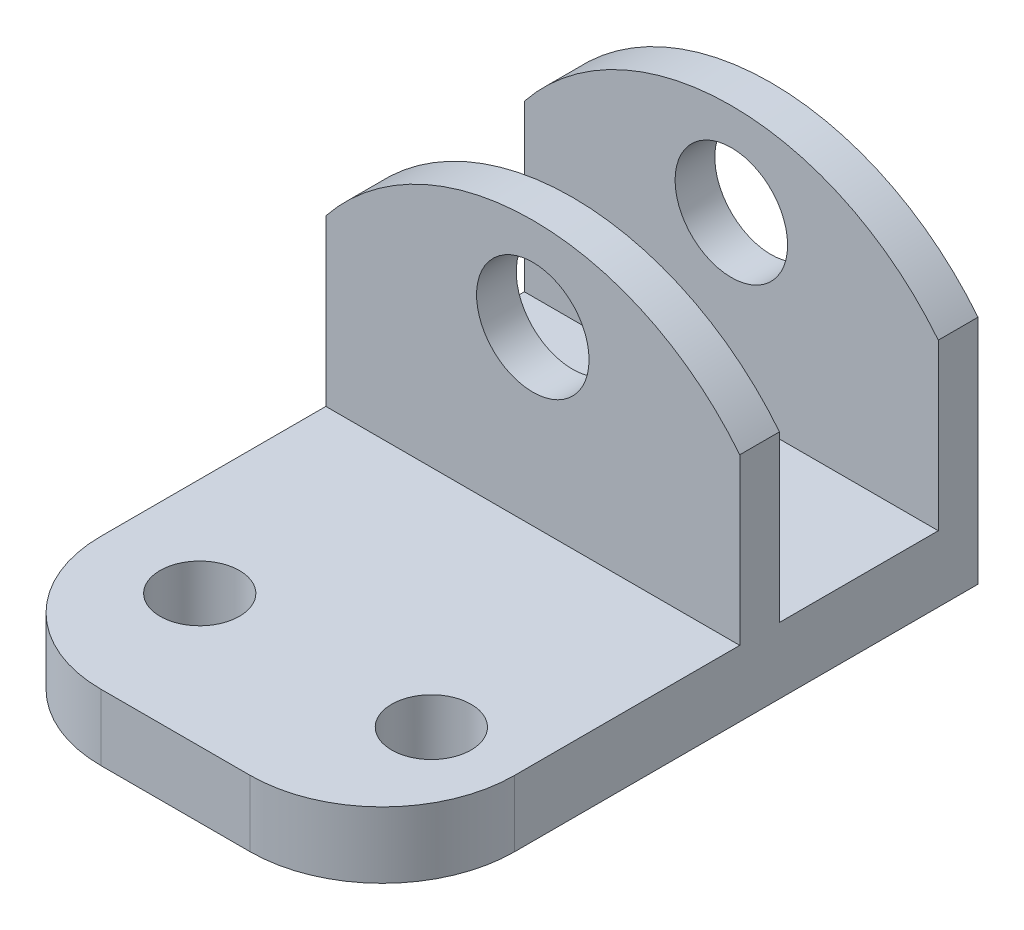
ISO-10303-21;
HEADER;
FILE_DESCRIPTION(('STEP AP214'),'2;1');
FILE_NAME('part.step','',(''),(''),'','','');
FILE_SCHEMA(('AUTOMOTIVE_DESIGN { 1 0 10303 214 1 1 1 1 }'));
ENDSEC;
DATA;
#1=APPLICATION_CONTEXT('core data for automotive mechanical design processes');
#2=APPLICATION_PROTOCOL_DEFINITION('international standard','automotive_design',2000,#1);
#3=PRODUCT_CONTEXT('',#1,'mechanical');
#4=PRODUCT('Part','Part','',(#3));
#5=PRODUCT_RELATED_PRODUCT_CATEGORY('part','',(#4));
#6=PRODUCT_DEFINITION_FORMATION('','',#4);
#7=PRODUCT_DEFINITION_CONTEXT('part definition',#1,'design');
#8=PRODUCT_DEFINITION('design','',#6,#7);
#9=PRODUCT_DEFINITION_SHAPE('','',#8);
#10=(LENGTH_UNIT() NAMED_UNIT(*) SI_UNIT(.MILLI.,.METRE.));
#11=(NAMED_UNIT(*) PLANE_ANGLE_UNIT() SI_UNIT($,.RADIAN.));
#12=(NAMED_UNIT(*) SI_UNIT($,.STERADIAN.) SOLID_ANGLE_UNIT());
#13=UNCERTAINTY_MEASURE_WITH_UNIT(LENGTH_MEASURE(1.E-05),#10,'distance_accuracy_value','');
#14=(GEOMETRIC_REPRESENTATION_CONTEXT(3) GLOBAL_UNCERTAINTY_ASSIGNED_CONTEXT((#13)) GLOBAL_UNIT_ASSIGNED_CONTEXT((#10,
#11,#12)) REPRESENTATION_CONTEXT('',''));
#15=CARTESIAN_POINT('',(0.,0.,0.));
#16=DIRECTION('',(0.,0.,1.));
#17=DIRECTION('',(1.,0.,0.));
#18=AXIS2_PLACEMENT_3D('',#15,#16,#17);
#19=CARTESIAN_POINT('',(0.,8.,0.));
#20=DIRECTION('',(0.,-1.,0.));
#21=DIRECTION('',(0.,0.,-1.));
#22=AXIS2_PLACEMENT_3D('',#19,#20,#21);
#23=PLANE('',#22);
#24=DIRECTION('',(-1.,0.,0.));
#25=VECTOR('',#24,1.);
#26=CARTESIAN_POINT('',(20.,8.,-38.));
#27=LINE('',#26,#25);
#28=CARTESIAN_POINT('',(20.,8.,-38.));
#29=VERTEX_POINT('',#28);
#30=CARTESIAN_POINT('',(-11.2715875597686,8.,-38.));
#31=VERTEX_POINT('',#30);
#32=EDGE_CURVE('E249',#29,#31,#27,.T.);
#33=ORIENTED_EDGE('',*,*,#32,.F.);
#34=DIRECTION('',(0.,0.,-1.));
#35=VECTOR('',#34,1.);
#36=CARTESIAN_POINT('',(20.,8.,0.));
#37=LINE('',#36,#35);
#38=CARTESIAN_POINT('',(20.,8.,-50.));
#39=VERTEX_POINT('',#38);
#40=EDGE_CURVE('E176',#29,#39,#37,.T.);
#41=ORIENTED_EDGE('',*,*,#40,.T.);
#42=DIRECTION('',(1.,0.,0.));
#43=VECTOR('',#42,1.);
#44=CARTESIAN_POINT('',(20.,8.,-50.));
#45=LINE('',#44,#43);
#46=CARTESIAN_POINT('',(-11.2715875597686,8.,-50.));
#47=VERTEX_POINT('',#46);
#48=EDGE_CURVE('E186',#47,#39,#45,.T.);
#49=ORIENTED_EDGE('',*,*,#48,.F.);
#50=DIRECTION('',(0.,0.,-1.));
#51=VECTOR('',#50,1.);
#52=CARTESIAN_POINT('',(-11.2715875597686,8.,-8.00000000009428));
#53=LINE('',#52,#51);
#54=EDGE_CURVE('E153',#31,#47,#53,.T.);
#55=ORIENTED_EDGE('',*,*,#54,.F.);
#56=EDGE_LOOP('',(#33,#41,#49,#55));
#57=FACE_BOUND('',#56,.T.);
#58=ADVANCED_FACE('F35',(#57),#23,.F.);
#59=CARTESIAN_POINT('',(-3.8,8.,-18.0000000000943));
#60=DIRECTION('',(0.,-1.,0.));
#61=DIRECTION('',(0.,0.,-1.));
#62=AXIS2_PLACEMENT_3D('',#59,#60,#61);
#63=CIRCLE('',#62,3.);
#64=CARTESIAN_POINT('',(-3.8,8.,-21.0000000000943));
#65=VERTEX_POINT('',#64);
#66=EDGE_CURVE('E163',#65,#65,#63,.T.);
#67=ORIENTED_EDGE('',*,*,#66,.T.);
#68=EDGE_LOOP('',(#67));
#69=FACE_BOUND('',#68,.T.);
#70=CARTESIAN_POINT('',(13.7,8.,-18.0000000000943));
#71=DIRECTION('',(0.,-1.,0.));
#72=DIRECTION('',(0.,0.,-1.));
#73=AXIS2_PLACEMENT_3D('',#70,#71,#72);
#74=CIRCLE('',#73,3.);
#75=CARTESIAN_POINT('',(13.7,8.,-21.0000000000943));
#76=VERTEX_POINT('',#75);
#77=EDGE_CURVE('E203',#76,#76,#74,.T.);
#78=ORIENTED_EDGE('',*,*,#77,.T.);
#79=EDGE_LOOP('',(#78));
#80=FACE_BOUND('',#79,.T.);
#81=CARTESIAN_POINT('',(-11.2715875597686,8.,-18.0000000000943));
#82=VERTEX_POINT('',#81);
#83=CARTESIAN_POINT('',(-11.2715875597686,8.,-35.));
#84=VERTEX_POINT('',#83);
#85=EDGE_CURVE('E167',#82,#84,#53,.T.);
#86=ORIENTED_EDGE('',*,*,#85,.F.);
#87=CARTESIAN_POINT('',(-1.27158755976865,8.,-18.0000000000943));
#88=DIRECTION('',(0.,-1.,0.));
#89=DIRECTION('',(0.,0.,-1.));
#90=AXIS2_PLACEMENT_3D('',#87,#88,#89);
#91=CIRCLE('',#90,10.);
#92=CARTESIAN_POINT('',(-1.27158755976865,8.,-8.00000000009428));
#93=VERTEX_POINT('',#92);
#94=EDGE_CURVE('E43',#82,#93,#91,.F.);
#95=ORIENTED_EDGE('',*,*,#94,.T.);
#96=DIRECTION('',(1.,0.,0.));
#97=VECTOR('',#96,1.);
#98=CARTESIAN_POINT('',(0.,8.,-8.00000000009428));
#99=LINE('',#98,#97);
#100=CARTESIAN_POINT('',(10.,8.,-8.00000000009428));
#101=VERTEX_POINT('',#100);
#102=EDGE_CURVE('E181',#93,#101,#99,.T.);
#103=ORIENTED_EDGE('',*,*,#102,.T.);
#104=CARTESIAN_POINT('',(10.,8.,-18.0000000000943));
#105=DIRECTION('',(0.,-1.,0.));
#106=DIRECTION('',(0.,0.,-1.));
#107=AXIS2_PLACEMENT_3D('',#104,#105,#106);
#108=CIRCLE('',#107,10.);
#109=CARTESIAN_POINT('',(20.,8.,-18.0000000000943));
#110=VERTEX_POINT('',#109);
#111=EDGE_CURVE('E50',#101,#110,#108,.F.);
#112=ORIENTED_EDGE('',*,*,#111,.T.);
#113=CARTESIAN_POINT('',(20.,8.,-35.));
#114=VERTEX_POINT('',#113);
#115=EDGE_CURVE('E180',#110,#114,#37,.T.);
#116=ORIENTED_EDGE('',*,*,#115,.T.);
#117=DIRECTION('',(1.,0.,0.));
#118=VECTOR('',#117,1.);
#119=CARTESIAN_POINT('',(20.,8.,-35.));
#120=LINE('',#119,#118);
#121=EDGE_CURVE('E252',#84,#114,#120,.T.);
#122=ORIENTED_EDGE('',*,*,#121,.F.);
#123=EDGE_LOOP('',(#86,#95,#103,#112,#116,#122));
#124=FACE_BOUND('',#123,.T.);
#125=ADVANCED_FACE('F193',(#69,#80,#124),#23,.F.);
#126=CARTESIAN_POINT('',(-19.9999999999057,20.,-8.00000000009428));
#127=DIRECTION('',(0.,0.,-1.));
#128=DIRECTION('',(-1.,0.,0.));
#129=AXIS2_PLACEMENT_3D('',#126,#127,#128);
#130=PLANE('',#129);
#131=ORIENTED_EDGE('',*,*,#102,.F.);
#132=DIRECTION('',(0.,-1.,0.));
#133=VECTOR('',#132,1.);
#134=CARTESIAN_POINT('',(-1.27158755976865,20.,-8.00000000009428));
#135=LINE('',#134,#133);
#136=CARTESIAN_POINT('',(-1.27158755976865,3.,-8.00000000009428));
#137=VERTEX_POINT('',#136);
#138=EDGE_CURVE('E201',#93,#137,#135,.T.);
#139=ORIENTED_EDGE('',*,*,#138,.T.);
#140=DIRECTION('',(-1.,0.,0.));
#141=VECTOR('',#140,1.);
#142=CARTESIAN_POINT('',(20.,3.,-8.00000000009428));
#143=LINE('',#142,#141);
#144=CARTESIAN_POINT('',(10.,3.,-8.00000000009428));
#145=VERTEX_POINT('',#144);
#146=EDGE_CURVE('E144',#145,#137,#143,.T.);
#147=ORIENTED_EDGE('',*,*,#146,.F.);
#148=DIRECTION('',(0.,-1.,0.));
#149=VECTOR('',#148,1.);
#150=CARTESIAN_POINT('',(10.,20.,-8.00000000009428));
#151=LINE('',#150,#149);
#152=EDGE_CURVE('E190',#145,#101,#151,.F.);
#153=ORIENTED_EDGE('',*,*,#152,.T.);
#154=EDGE_LOOP('',(#131,#139,#147,#153));
#155=FACE_BOUND('',#154,.T.);
#156=ADVANCED_FACE('F199',(#155),#130,.F.);
#157=CARTESIAN_POINT('',(20.,50.,-33.0001030918695));
#158=DIRECTION('',(-1.,0.,0.));
#159=DIRECTION('',(0.,0.,1.));
#160=AXIS2_PLACEMENT_3D('',#157,#158,#159);
#161=PLANE('',#160);
#162=ORIENTED_EDGE('',*,*,#115,.F.);
#163=DIRECTION('',(0.,-1.,0.));
#164=VECTOR('',#163,1.);
#165=CARTESIAN_POINT('',(20.,50.,-18.0000000000943));
#166=LINE('',#165,#164);
#167=CARTESIAN_POINT('',(20.,3.,-18.0000000000943));
#168=VERTEX_POINT('',#167);
#169=EDGE_CURVE('E11',#110,#168,#166,.T.);
#170=ORIENTED_EDGE('',*,*,#169,.T.);
#171=DIRECTION('',(0.,0.,1.));
#172=VECTOR('',#171,1.);
#173=CARTESIAN_POINT('',(20.,3.,-8.00000000009428));
#174=LINE('',#173,#172);
#175=CARTESIAN_POINT('',(20.,3.,-53.));
#176=VERTEX_POINT('',#175);
#177=EDGE_CURVE('E131',#176,#168,#174,.T.);
#178=ORIENTED_EDGE('',*,*,#177,.F.);
#179=DIRECTION('',(0.,-1.,0.));
#180=VECTOR('',#179,1.);
#181=CARTESIAN_POINT('',(20.,0.,-53.));
#182=LINE('',#181,#180);
#183=CARTESIAN_POINT('',(20.,20.4708441122857,-53.));
#184=VERTEX_POINT('',#183);
#185=EDGE_CURVE('E142',#184,#176,#182,.T.);
#186=ORIENTED_EDGE('',*,*,#185,.F.);
#187=DIRECTION('',(0.,0.,1.));
#188=VECTOR('',#187,1.);
#189=CARTESIAN_POINT('',(20.,20.4708441122857,-55.));
#190=LINE('',#189,#188);
#191=CARTESIAN_POINT('',(20.,20.4708441122857,-50.));
#192=VERTEX_POINT('',#191);
#193=EDGE_CURVE('E228',#184,#192,#190,.T.);
#194=ORIENTED_EDGE('',*,*,#193,.T.);
#195=DIRECTION('',(0.,-1.,0.));
#196=VECTOR('',#195,1.);
#197=CARTESIAN_POINT('',(20.,28.,-50.));
#198=LINE('',#197,#196);
#199=EDGE_CURVE('E155',#192,#39,#198,.T.);
#200=ORIENTED_EDGE('',*,*,#199,.T.);
#201=ORIENTED_EDGE('',*,*,#40,.F.);
#202=DIRECTION('',(0.,-1.,0.));
#203=VECTOR('',#202,1.);
#204=CARTESIAN_POINT('',(20.,28.,-38.));
#205=LINE('',#204,#203);
#206=CARTESIAN_POINT('',(20.,20.4708441122857,-38.));
#207=VERTEX_POINT('',#206);
#208=EDGE_CURVE('E262',#207,#29,#205,.T.);
#209=ORIENTED_EDGE('',*,*,#208,.F.);
#210=CARTESIAN_POINT('',(20.,20.4708441122857,-35.));
#211=VERTEX_POINT('',#210);
#212=EDGE_CURVE('E223',#207,#211,#190,.T.);
#213=ORIENTED_EDGE('',*,*,#212,.T.);
#214=DIRECTION('',(0.,-1.,0.));
#215=VECTOR('',#214,1.);
#216=CARTESIAN_POINT('',(20.,28.,-35.));
#217=LINE('',#216,#215);
#218=EDGE_CURVE('E255',#211,#114,#217,.T.);
#219=ORIENTED_EDGE('',*,*,#218,.T.);
#220=EDGE_LOOP('',(#162,#170,#178,#186,#194,#200,#201,#209,#213,#219));
#221=FACE_BOUND('',#220,.T.);
#222=ADVANCED_FACE('F140',(#221),#161,.F.);
#223=CARTESIAN_POINT('',(13.7,10.,-18.0000000000943));
#224=DIRECTION('',(0.,-1.,0.));
#225=DIRECTION('',(0.,0.,-1.));
#226=AXIS2_PLACEMENT_3D('',#223,#224,#225);
#227=CYLINDRICAL_SURFACE('',#226,3.);
#228=CARTESIAN_POINT('',(13.7,3.,-18.0000000000943));
#229=DIRECTION('',(0.,1.,0.));
#230=DIRECTION('',(0.,0.,1.));
#231=AXIS2_PLACEMENT_3D('',#228,#229,#230);
#232=CIRCLE('',#231,3.);
#233=CARTESIAN_POINT('',(13.7,3.,-15.0000000000943));
#234=VERTEX_POINT('',#233);
#235=EDGE_CURVE('E218',#234,#234,#232,.F.);
#236=ORIENTED_EDGE('',*,*,#235,.T.);
#237=EDGE_LOOP('',(#236));
#238=FACE_BOUND('',#237,.T.);
#239=ORIENTED_EDGE('',*,*,#77,.F.);
#240=EDGE_LOOP('',(#239));
#241=FACE_BOUND('',#240,.T.);
#242=ADVANCED_FACE('F301',(#238,#241),#227,.F.);
#243=CARTESIAN_POINT('',(-3.8,10.,-18.0000000000943));
#244=DIRECTION('',(0.,-1.,0.));
#245=DIRECTION('',(0.,0.,-1.));
#246=AXIS2_PLACEMENT_3D('',#243,#244,#245);
#247=CYLINDRICAL_SURFACE('',#246,3.);
#248=CARTESIAN_POINT('',(-3.8,3.,-18.0000000000943));
#249=DIRECTION('',(0.,1.,0.));
#250=DIRECTION('',(0.,0.,1.));
#251=AXIS2_PLACEMENT_3D('',#248,#249,#250);
#252=CIRCLE('',#251,3.);
#253=CARTESIAN_POINT('',(-3.8,3.,-15.0000000000943));
#254=VERTEX_POINT('',#253);
#255=EDGE_CURVE('E136',#254,#254,#252,.F.);
#256=ORIENTED_EDGE('',*,*,#255,.T.);
#257=EDGE_LOOP('',(#256));
#258=FACE_BOUND('',#257,.T.);
#259=ORIENTED_EDGE('',*,*,#66,.F.);
#260=EDGE_LOOP('',(#259));
#261=FACE_BOUND('',#260,.T.);
#262=ADVANCED_FACE('F304',(#258,#261),#247,.F.);
#263=CARTESIAN_POINT('',(-11.2715875597686,-2.,-8.00000000009428));
#264=DIRECTION('',(1.,0.,0.));
#265=DIRECTION('',(0.,0.,-1.));
#266=AXIS2_PLACEMENT_3D('',#263,#264,#265);
#267=PLANE('',#266);
#268=DIRECTION('',(0.,0.,-1.));
#269=VECTOR('',#268,1.);
#270=CARTESIAN_POINT('',(-11.2715875597686,3.,-8.00000000009428));
#271=LINE('',#270,#269);
#272=CARTESIAN_POINT('',(-11.2715875597686,3.,-18.0000000000943));
#273=VERTEX_POINT('',#272);
#274=CARTESIAN_POINT('',(-11.2715875597686,3.,-53.));
#275=VERTEX_POINT('',#274);
#276=EDGE_CURVE('E132',#273,#275,#271,.T.);
#277=ORIENTED_EDGE('',*,*,#276,.F.);
#278=DIRECTION('',(0.,-1.,0.));
#279=VECTOR('',#278,1.);
#280=CARTESIAN_POINT('',(-11.2715875597686,-2.,-18.0000000000943));
#281=LINE('',#280,#279);
#282=EDGE_CURVE('E58',#273,#82,#281,.F.);
#283=ORIENTED_EDGE('',*,*,#282,.T.);
#284=ORIENTED_EDGE('',*,*,#85,.T.);
#285=DIRECTION('',(0.,-1.,0.));
#286=VECTOR('',#285,1.);
#287=CARTESIAN_POINT('',(-11.2715875597686,28.,-35.));
#288=LINE('',#287,#286);
#289=CARTESIAN_POINT('',(-11.2715875597686,20.4708441122857,-35.));
#290=VERTEX_POINT('',#289);
#291=EDGE_CURVE('E258',#290,#84,#288,.T.);
#292=ORIENTED_EDGE('',*,*,#291,.F.);
#293=DIRECTION('',(0.,0.,1.));
#294=VECTOR('',#293,1.);
#295=CARTESIAN_POINT('',(-11.2715875597686,20.4708441122857,-55.));
#296=LINE('',#295,#294);
#297=CARTESIAN_POINT('',(-11.2715875597686,20.4708441122857,-38.));
#298=VERTEX_POINT('',#297);
#299=EDGE_CURVE('E224',#298,#290,#296,.T.);
#300=ORIENTED_EDGE('',*,*,#299,.F.);
#301=DIRECTION('',(0.,-1.,0.));
#302=VECTOR('',#301,1.);
#303=CARTESIAN_POINT('',(-11.2715875597686,28.,-38.));
#304=LINE('',#303,#302);
#305=EDGE_CURVE('E261',#298,#31,#304,.T.);
#306=ORIENTED_EDGE('',*,*,#305,.T.);
#307=ORIENTED_EDGE('',*,*,#54,.T.);
#308=DIRECTION('',(0.,-1.,0.));
#309=VECTOR('',#308,1.);
#310=CARTESIAN_POINT('',(-11.2715875597686,28.,-50.));
#311=LINE('',#310,#309);
#312=CARTESIAN_POINT('',(-11.2715875597686,20.4708441122857,-50.));
#313=VERTEX_POINT('',#312);
#314=EDGE_CURVE('E151',#313,#47,#311,.T.);
#315=ORIENTED_EDGE('',*,*,#314,.F.);
#316=CARTESIAN_POINT('',(-11.2715875597686,20.4708441122857,-53.));
#317=VERTEX_POINT('',#316);
#318=EDGE_CURVE('E227',#317,#313,#296,.T.);
#319=ORIENTED_EDGE('',*,*,#318,.F.);
#320=DIRECTION('',(0.,1.,0.));
#321=VECTOR('',#320,1.);
#322=CARTESIAN_POINT('',(-11.2715875597686,0.,-53.));
#323=LINE('',#322,#321);
#324=EDGE_CURVE('E150',#275,#317,#323,.T.);
#325=ORIENTED_EDGE('',*,*,#324,.F.);
#326=EDGE_LOOP('',(#277,#283,#284,#292,#300,#306,#307,#315,#319,#325));
#327=FACE_BOUND('',#326,.T.);
#328=ADVANCED_FACE('F211',(#327),#267,.F.);
#329=CARTESIAN_POINT('',(0.,0.,-53.));
#330=DIRECTION('',(0.,0.,1.));
#331=DIRECTION('',(1.,0.,0.));
#332=AXIS2_PLACEMENT_3D('',#329,#330,#331);
#333=PLANE('',#332);
#334=CARTESIAN_POINT('',(4.36420622011568,21.,-53.));
#335=DIRECTION('',(0.,0.,1.));
#336=DIRECTION('',(1.,0.,0.));
#337=AXIS2_PLACEMENT_3D('',#334,#335,#336);
#338=CIRCLE('',#337,4.25);
#339=CARTESIAN_POINT('',(8.61420622011568,21.,-53.));
#340=VERTEX_POINT('',#339);
#341=EDGE_CURVE('E246',#340,#340,#338,.T.);
#342=ORIENTED_EDGE('',*,*,#341,.T.);
#343=EDGE_LOOP('',(#342));
#344=FACE_BOUND('',#343,.T.);
#345=ORIENTED_EDGE('',*,*,#185,.T.);
#346=DIRECTION('',(1.,0.,0.));
#347=VECTOR('',#346,1.);
#348=CARTESIAN_POINT('',(20.,3.,-53.));
#349=LINE('',#348,#347);
#350=EDGE_CURVE('E126',#275,#176,#349,.T.);
#351=ORIENTED_EDGE('',*,*,#350,.F.);
#352=ORIENTED_EDGE('',*,*,#324,.T.);
#353=CARTESIAN_POINT('',(4.36420622011568,8.,-53.));
#354=DIRECTION('',(0.,0.,1.));
#355=DIRECTION('',(1.,0.,0.));
#356=AXIS2_PLACEMENT_3D('',#353,#354,#355);
#357=CIRCLE('',#356,20.);
#358=EDGE_CURVE('E148',#317,#184,#357,.F.);
#359=ORIENTED_EDGE('',*,*,#358,.T.);
#360=EDGE_LOOP('',(#345,#351,#352,#359));
#361=FACE_BOUND('',#360,.T.);
#362=ADVANCED_FACE('F146',(#344,#361),#333,.F.);
#363=CARTESIAN_POINT('',(20.,28.,-50.));
#364=DIRECTION('',(0.,0.,-1.));
#365=DIRECTION('',(-1.,0.,0.));
#366=AXIS2_PLACEMENT_3D('',#363,#364,#365);
#367=PLANE('',#366);
#368=CARTESIAN_POINT('',(4.36420622011568,21.,-50.));
#369=DIRECTION('',(0.,0.,-1.));
#370=DIRECTION('',(-1.,0.,0.));
#371=AXIS2_PLACEMENT_3D('',#368,#369,#370);
#372=CIRCLE('',#371,4.25);
#373=CARTESIAN_POINT('',(0.114206220115678,21.,-50.));
#374=VERTEX_POINT('',#373);
#375=EDGE_CURVE('E243',#374,#374,#372,.T.);
#376=ORIENTED_EDGE('',*,*,#375,.T.);
#377=EDGE_LOOP('',(#376));
#378=FACE_BOUND('',#377,.T.);
#379=ORIENTED_EDGE('',*,*,#199,.F.);
#380=CARTESIAN_POINT('',(4.36420622011568,8.,-50.));
#381=DIRECTION('',(0.,0.,-1.));
#382=DIRECTION('',(-1.,0.,0.));
#383=AXIS2_PLACEMENT_3D('',#380,#381,#382);
#384=CIRCLE('',#383,20.);
#385=EDGE_CURVE('E233',#192,#313,#384,.F.);
#386=ORIENTED_EDGE('',*,*,#385,.T.);
#387=ORIENTED_EDGE('',*,*,#314,.T.);
#388=ORIENTED_EDGE('',*,*,#48,.T.);
#389=EDGE_LOOP('',(#379,#386,#387,#388));
#390=FACE_BOUND('',#389,.T.);
#391=ADVANCED_FACE('F313',(#378,#390),#367,.F.);
#392=CARTESIAN_POINT('',(20.,28.,-38.));
#393=DIRECTION('',(0.,0.,1.));
#394=DIRECTION('',(1.,0.,0.));
#395=AXIS2_PLACEMENT_3D('',#392,#393,#394);
#396=PLANE('',#395);
#397=CARTESIAN_POINT('',(4.36420622011568,21.,-38.));
#398=DIRECTION('',(0.,0.,1.));
#399=DIRECTION('',(1.,0.,0.));
#400=AXIS2_PLACEMENT_3D('',#397,#398,#399);
#401=CIRCLE('',#400,4.25);
#402=CARTESIAN_POINT('',(8.61420622011568,21.,-38.));
#403=VERTEX_POINT('',#402);
#404=EDGE_CURVE('E240',#403,#403,#401,.T.);
#405=ORIENTED_EDGE('',*,*,#404,.T.);
#406=EDGE_LOOP('',(#405));
#407=FACE_BOUND('',#406,.T.);
#408=ORIENTED_EDGE('',*,*,#305,.F.);
#409=CARTESIAN_POINT('',(4.36420622011568,8.,-38.));
#410=DIRECTION('',(0.,0.,1.));
#411=DIRECTION('',(1.,0.,0.));
#412=AXIS2_PLACEMENT_3D('',#409,#410,#411);
#413=CIRCLE('',#412,20.);
#414=EDGE_CURVE('E231',#298,#207,#413,.F.);
#415=ORIENTED_EDGE('',*,*,#414,.T.);
#416=ORIENTED_EDGE('',*,*,#208,.T.);
#417=ORIENTED_EDGE('',*,*,#32,.T.);
#418=EDGE_LOOP('',(#408,#415,#416,#417));
#419=FACE_BOUND('',#418,.T.);
#420=ADVANCED_FACE('F274',(#407,#419),#396,.F.);
#421=CARTESIAN_POINT('',(20.,28.,-35.));
#422=DIRECTION('',(0.,0.,-1.));
#423=DIRECTION('',(-1.,0.,0.));
#424=AXIS2_PLACEMENT_3D('',#421,#422,#423);
#425=PLANE('',#424);
#426=CARTESIAN_POINT('',(4.36420622011568,21.,-35.));
#427=DIRECTION('',(0.,0.,1.));
#428=DIRECTION('',(1.,0.,0.));
#429=AXIS2_PLACEMENT_3D('',#426,#427,#428);
#430=CIRCLE('',#429,4.25);
#431=CARTESIAN_POINT('',(8.61420622011568,21.,-35.));
#432=VERTEX_POINT('',#431);
#433=EDGE_CURVE('E237',#432,#432,#430,.T.);
#434=ORIENTED_EDGE('',*,*,#433,.F.);
#435=EDGE_LOOP('',(#434));
#436=FACE_BOUND('',#435,.T.);
#437=ORIENTED_EDGE('',*,*,#218,.F.);
#438=CARTESIAN_POINT('',(4.36420622011568,8.,-35.));
#439=DIRECTION('',(0.,0.,-1.));
#440=DIRECTION('',(-1.,0.,0.));
#441=AXIS2_PLACEMENT_3D('',#438,#439,#440);
#442=CIRCLE('',#441,20.);
#443=EDGE_CURVE('E221',#290,#211,#442,.T.);
#444=ORIENTED_EDGE('',*,*,#443,.F.);
#445=ORIENTED_EDGE('',*,*,#291,.T.);
#446=ORIENTED_EDGE('',*,*,#121,.T.);
#447=EDGE_LOOP('',(#437,#444,#445,#446));
#448=FACE_BOUND('',#447,.T.);
#449=ADVANCED_FACE('F283',(#436,#448),#425,.F.);
#450=CARTESIAN_POINT('',(4.36420622011568,21.,-55.));
#451=DIRECTION('',(0.,0.,1.));
#452=DIRECTION('',(1.,0.,0.));
#453=AXIS2_PLACEMENT_3D('',#450,#451,#452);
#454=CYLINDRICAL_SURFACE('',#453,4.25);
#455=ORIENTED_EDGE('',*,*,#433,.T.);
#456=EDGE_LOOP('',(#455));
#457=FACE_BOUND('',#456,.T.);
#458=ORIENTED_EDGE('',*,*,#404,.F.);
#459=EDGE_LOOP('',(#458));
#460=FACE_BOUND('',#459,.T.);
#461=ADVANCED_FACE('F323',(#457,#460),#454,.F.);
#462=ORIENTED_EDGE('',*,*,#375,.F.);
#463=EDGE_LOOP('',(#462));
#464=FACE_BOUND('',#463,.T.);
#465=ORIENTED_EDGE('',*,*,#341,.F.);
#466=EDGE_LOOP('',(#465));
#467=FACE_BOUND('',#466,.T.);
#468=ADVANCED_FACE('F325',(#464,#467),#454,.F.);
#469=CARTESIAN_POINT('',(4.36420622011568,8.,-55.));
#470=DIRECTION('',(0.,0.,1.));
#471=DIRECTION('',(1.,0.,0.));
#472=AXIS2_PLACEMENT_3D('',#469,#470,#471);
#473=CYLINDRICAL_SURFACE('',#472,20.);
#474=ORIENTED_EDGE('',*,*,#299,.T.);
#475=ORIENTED_EDGE('',*,*,#443,.T.);
#476=ORIENTED_EDGE('',*,*,#212,.F.);
#477=ORIENTED_EDGE('',*,*,#414,.F.);
#478=EDGE_LOOP('',(#474,#475,#476,#477));
#479=FACE_BOUND('',#478,.T.);
#480=ADVANCED_FACE('F280',(#479),#473,.T.);
#481=ORIENTED_EDGE('',*,*,#318,.T.);
#482=ORIENTED_EDGE('',*,*,#385,.F.);
#483=ORIENTED_EDGE('',*,*,#193,.F.);
#484=ORIENTED_EDGE('',*,*,#358,.F.);
#485=EDGE_LOOP('',(#481,#482,#483,#484));
#486=FACE_BOUND('',#485,.T.);
#487=ADVANCED_FACE('F329',(#486),#473,.T.);
#488=CARTESIAN_POINT('',(0.,3.,0.));
#489=DIRECTION('',(0.,1.,0.));
#490=DIRECTION('',(0.,0.,1.));
#491=AXIS2_PLACEMENT_3D('',#488,#489,#490);
#492=PLANE('',#491);
#493=ORIENTED_EDGE('',*,*,#255,.F.);
#494=EDGE_LOOP('',(#493));
#495=FACE_BOUND('',#494,.T.);
#496=ORIENTED_EDGE('',*,*,#146,.T.);
#497=CARTESIAN_POINT('',(-1.27158755976865,3.,-18.0000000000943));
#498=DIRECTION('',(0.,1.,0.));
#499=DIRECTION('',(0.,0.,1.));
#500=AXIS2_PLACEMENT_3D('',#497,#498,#499);
#501=CIRCLE('',#500,10.);
#502=EDGE_CURVE('E206',#137,#273,#501,.F.);
#503=ORIENTED_EDGE('',*,*,#502,.T.);
#504=ORIENTED_EDGE('',*,*,#276,.T.);
#505=ORIENTED_EDGE('',*,*,#350,.T.);
#506=ORIENTED_EDGE('',*,*,#177,.T.);
#507=CARTESIAN_POINT('',(10.,3.,-18.0000000000943));
#508=DIRECTION('',(0.,1.,0.));
#509=DIRECTION('',(0.,0.,1.));
#510=AXIS2_PLACEMENT_3D('',#507,#508,#509);
#511=CIRCLE('',#510,10.);
#512=EDGE_CURVE('E207',#168,#145,#511,.F.);
#513=ORIENTED_EDGE('',*,*,#512,.T.);
#514=EDGE_LOOP('',(#496,#503,#504,#505,#506,#513));
#515=FACE_BOUND('',#514,.T.);
#516=ORIENTED_EDGE('',*,*,#235,.F.);
#517=EDGE_LOOP('',(#516));
#518=FACE_BOUND('',#517,.T.);
#519=ADVANCED_FACE('F129',(#495,#515,#518),#492,.F.);
#520=CARTESIAN_POINT('',(-1.27158755976865,20.,-18.0000000000943));
#521=DIRECTION('',(0.,-1.,0.));
#522=DIRECTION('',(0.,0.,-1.));
#523=AXIS2_PLACEMENT_3D('',#520,#521,#522);
#524=CYLINDRICAL_SURFACE('',#523,10.);
#525=ORIENTED_EDGE('',*,*,#94,.F.);
#526=ORIENTED_EDGE('',*,*,#282,.F.);
#527=ORIENTED_EDGE('',*,*,#502,.F.);
#528=ORIENTED_EDGE('',*,*,#138,.F.);
#529=EDGE_LOOP('',(#525,#526,#527,#528));
#530=FACE_BOUND('',#529,.T.);
#531=ADVANCED_FACE('F205',(#530),#524,.T.);
#532=CARTESIAN_POINT('',(10.,50.,-18.0000000000943));
#533=DIRECTION('',(0.,-1.,0.));
#534=DIRECTION('',(0.,0.,-1.));
#535=AXIS2_PLACEMENT_3D('',#532,#533,#534);
#536=CYLINDRICAL_SURFACE('',#535,10.);
#537=ORIENTED_EDGE('',*,*,#111,.F.);
#538=ORIENTED_EDGE('',*,*,#152,.F.);
#539=ORIENTED_EDGE('',*,*,#512,.F.);
#540=ORIENTED_EDGE('',*,*,#169,.F.);
#541=EDGE_LOOP('',(#537,#538,#539,#540));
#542=FACE_BOUND('',#541,.T.);
#543=ADVANCED_FACE('F37',(#542),#536,.T.);
#544=CLOSED_SHELL('',(#58,#125,#156,#222,#242,#262,#328,#362,#391,#420,#449,#461,#468,#480,#487,
#519,#531,#543));
#545=MANIFOLD_SOLID_BREP('B2',#544);
#546=ADVANCED_BREP_SHAPE_REPRESENTATION('',(#18,#545),#14);
#547=SHAPE_DEFINITION_REPRESENTATION(#9,#546);
ENDSEC;
END-ISO-10303-21;
